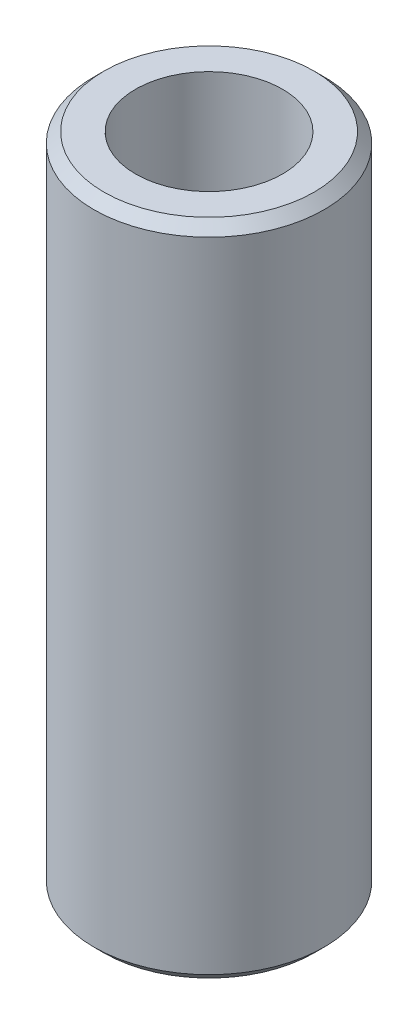
ISO-10303-21;
HEADER;
FILE_DESCRIPTION(('STEP AP214'),'2;1');
FILE_NAME('part.step','',(''),(''),'','','');
FILE_SCHEMA(('AUTOMOTIVE_DESIGN { 1 0 10303 214 1 1 1 1 }'));
ENDSEC;
DATA;
#1=APPLICATION_CONTEXT('core data for automotive mechanical design processes');
#2=APPLICATION_PROTOCOL_DEFINITION('international standard','automotive_design',2000,#1);
#3=PRODUCT_CONTEXT('',#1,'mechanical');
#4=PRODUCT('Part','Part','',(#3));
#5=PRODUCT_RELATED_PRODUCT_CATEGORY('part','',(#4));
#6=PRODUCT_DEFINITION_FORMATION('','',#4);
#7=PRODUCT_DEFINITION_CONTEXT('part definition',#1,'design');
#8=PRODUCT_DEFINITION('design','',#6,#7);
#9=PRODUCT_DEFINITION_SHAPE('','',#8);
#10=(LENGTH_UNIT() NAMED_UNIT(*) SI_UNIT(.MILLI.,.METRE.));
#11=(NAMED_UNIT(*) PLANE_ANGLE_UNIT() SI_UNIT($,.RADIAN.));
#12=(NAMED_UNIT(*) SI_UNIT($,.STERADIAN.) SOLID_ANGLE_UNIT());
#13=UNCERTAINTY_MEASURE_WITH_UNIT(LENGTH_MEASURE(1.E-05),#10,'distance_accuracy_value','');
#14=(GEOMETRIC_REPRESENTATION_CONTEXT(3) GLOBAL_UNCERTAINTY_ASSIGNED_CONTEXT((#13)) GLOBAL_UNIT_ASSIGNED_CONTEXT((#10,
#11,#12)) REPRESENTATION_CONTEXT('',''));
#15=CARTESIAN_POINT('',(0.,0.,0.));
#16=DIRECTION('',(0.,0.,1.));
#17=DIRECTION('',(1.,0.,0.));
#18=AXIS2_PLACEMENT_3D('',#15,#16,#17);
#19=CARTESIAN_POINT('',(0.,286.217433179224,0.));
#20=DIRECTION('',(0.,-1.,0.));
#21=DIRECTION('',(0.,0.,-1.));
#22=AXIS2_PLACEMENT_3D('',#19,#20,#21);
#23=CYLINDRICAL_SURFACE('',#22,50.);
#24=CARTESIAN_POINT('',(0.,281.828791588879,0.));
#25=DIRECTION('',(0.,1.,0.));
#26=DIRECTION('',(0.,0.,1.));
#27=AXIS2_PLACEMENT_3D('',#24,#25,#26);
#28=CIRCLE('',#27,50.);
#29=CARTESIAN_POINT('',(0.,281.828791588879,50.));
#30=VERTEX_POINT('',#29);
#31=EDGE_CURVE('E50',#30,#30,#28,.F.);
#32=ORIENTED_EDGE('',*,*,#31,.T.);
#33=EDGE_LOOP('',(#32));
#34=FACE_BOUND('',#33,.T.);
#35=CARTESIAN_POINT('',(0.,4.38864159034474,0.));
#36=DIRECTION('',(0.,1.,0.));
#37=DIRECTION('',(0.,0.,1.));
#38=AXIS2_PLACEMENT_3D('',#35,#36,#37);
#39=CIRCLE('',#38,50.);
#40=CARTESIAN_POINT('',(0.,4.38864159034474,50.));
#41=VERTEX_POINT('',#40);
#42=EDGE_CURVE('E51',#41,#41,#39,.T.);
#43=ORIENTED_EDGE('',*,*,#42,.T.);
#44=EDGE_LOOP('',(#43));
#45=FACE_BOUND('',#44,.T.);
#46=ADVANCED_FACE('F39',(#34,#45),#23,.T.);
#47=CARTESIAN_POINT('',(0.,286.217433179224,0.));
#48=DIRECTION('',(0.,1.,0.));
#49=DIRECTION('',(0.,0.,1.));
#50=AXIS2_PLACEMENT_3D('',#47,#48,#49);
#51=PLANE('',#50);
#52=CARTESIAN_POINT('',(0.,286.217433179224,0.));
#53=DIRECTION('',(0.,1.,0.));
#54=DIRECTION('',(0.,0.,1.));
#55=AXIS2_PLACEMENT_3D('',#52,#53,#54);
#56=CIRCLE('',#55,45.6113584096553);
#57=CARTESIAN_POINT('',(0.,286.217433179224,45.6113584096553));
#58=VERTEX_POINT('',#57);
#59=EDGE_CURVE('E54',#58,#58,#56,.T.);
#60=ORIENTED_EDGE('',*,*,#59,.T.);
#61=EDGE_LOOP('',(#60));
#62=FACE_BOUND('',#61,.T.);
#63=CARTESIAN_POINT('',(0.,286.217433179224,0.));
#64=DIRECTION('',(0.,1.,0.));
#65=DIRECTION('',(0.,0.,1.));
#66=AXIS2_PLACEMENT_3D('',#63,#64,#65);
#67=CIRCLE('',#66,31.9322142970482);
#68=CARTESIAN_POINT('',(0.,286.217433179224,31.9322142970482));
#69=VERTEX_POINT('',#68);
#70=EDGE_CURVE('E58',#69,#69,#67,.T.);
#71=ORIENTED_EDGE('',*,*,#70,.F.);
#72=EDGE_LOOP('',(#71));
#73=FACE_BOUND('',#72,.T.);
#74=ADVANCED_FACE('F69',(#62,#73),#51,.T.);
#75=CARTESIAN_POINT('',(0.,0.,0.));
#76=DIRECTION('',(0.,1.,0.));
#77=DIRECTION('',(0.,0.,1.));
#78=AXIS2_PLACEMENT_3D('',#75,#76,#77);
#79=PLANE('',#78);
#80=CARTESIAN_POINT('',(0.,0.,0.));
#81=DIRECTION('',(0.,1.,0.));
#82=DIRECTION('',(0.,0.,1.));
#83=AXIS2_PLACEMENT_3D('',#80,#81,#82);
#84=CIRCLE('',#83,45.6113584096552);
#85=CARTESIAN_POINT('',(0.,0.,45.6113584096552));
#86=VERTEX_POINT('',#85);
#87=EDGE_CURVE('E10',#86,#86,#84,.F.);
#88=ORIENTED_EDGE('',*,*,#87,.T.);
#89=EDGE_LOOP('',(#88));
#90=FACE_BOUND('',#89,.T.);
#91=CARTESIAN_POINT('',(0.,0.,0.));
#92=DIRECTION('',(0.,1.,0.));
#93=DIRECTION('',(0.,0.,1.));
#94=AXIS2_PLACEMENT_3D('',#91,#92,#93);
#95=CIRCLE('',#94,31.9322142970482);
#96=CARTESIAN_POINT('',(0.,0.,31.9322142970482));
#97=VERTEX_POINT('',#96);
#98=EDGE_CURVE('E63',#97,#97,#95,.T.);
#99=ORIENTED_EDGE('',*,*,#98,.T.);
#100=EDGE_LOOP('',(#99));
#101=FACE_BOUND('',#100,.T.);
#102=ADVANCED_FACE('F75',(#90,#101),#79,.F.);
#103=CARTESIAN_POINT('',(0.,286.217433179224,0.));
#104=DIRECTION('',(0.,-1.,0.));
#105=DIRECTION('',(0.,0.,-1.));
#106=AXIS2_PLACEMENT_3D('',#103,#104,#105);
#107=CYLINDRICAL_SURFACE('',#106,31.9322142970482);
#108=ORIENTED_EDGE('',*,*,#70,.T.);
#109=EDGE_LOOP('',(#108));
#110=FACE_BOUND('',#109,.T.);
#111=ORIENTED_EDGE('',*,*,#98,.F.);
#112=EDGE_LOOP('',(#111));
#113=FACE_BOUND('',#112,.T.);
#114=ADVANCED_FACE('F70',(#110,#113),#107,.F.);
#115=CARTESIAN_POINT('',(0.,286.217433179224,0.));
#116=DIRECTION('',(0.,-1.,0.));
#117=DIRECTION('',(0.,0.,-1.));
#118=AXIS2_PLACEMENT_3D('',#115,#116,#117);
#119=CONICAL_SURFACE('',#118,45.6113584096553,0.785398163397441);
#120=ORIENTED_EDGE('',*,*,#31,.F.);
#121=EDGE_LOOP('',(#120));
#122=FACE_BOUND('',#121,.T.);
#123=ORIENTED_EDGE('',*,*,#59,.F.);
#124=EDGE_LOOP('',(#123));
#125=FACE_BOUND('',#124,.T.);
#126=ADVANCED_FACE('F81',(#122,#125),#119,.T.);
#127=CARTESIAN_POINT('',(0.,4.38864159034474,0.));
#128=DIRECTION('',(0.,1.,0.));
#129=DIRECTION('',(0.,0.,1.));
#130=AXIS2_PLACEMENT_3D('',#127,#128,#129);
#131=CONICAL_SURFACE('',#130,50.,0.785398163397452);
#132=ORIENTED_EDGE('',*,*,#87,.F.);
#133=EDGE_LOOP('',(#132));
#134=FACE_BOUND('',#133,.T.);
#135=ORIENTED_EDGE('',*,*,#42,.F.);
#136=EDGE_LOOP('',(#135));
#137=FACE_BOUND('',#136,.T.);
#138=ADVANCED_FACE('F45',(#134,#137),#131,.T.);
#139=CLOSED_SHELL('',(#46,#74,#102,#114,#126,#138));
#140=MANIFOLD_SOLID_BREP('B2',#139);
#141=ADVANCED_BREP_SHAPE_REPRESENTATION('',(#18,#140),#14);
#142=SHAPE_DEFINITION_REPRESENTATION(#9,#141);
ENDSEC;
END-ISO-10303-21;
